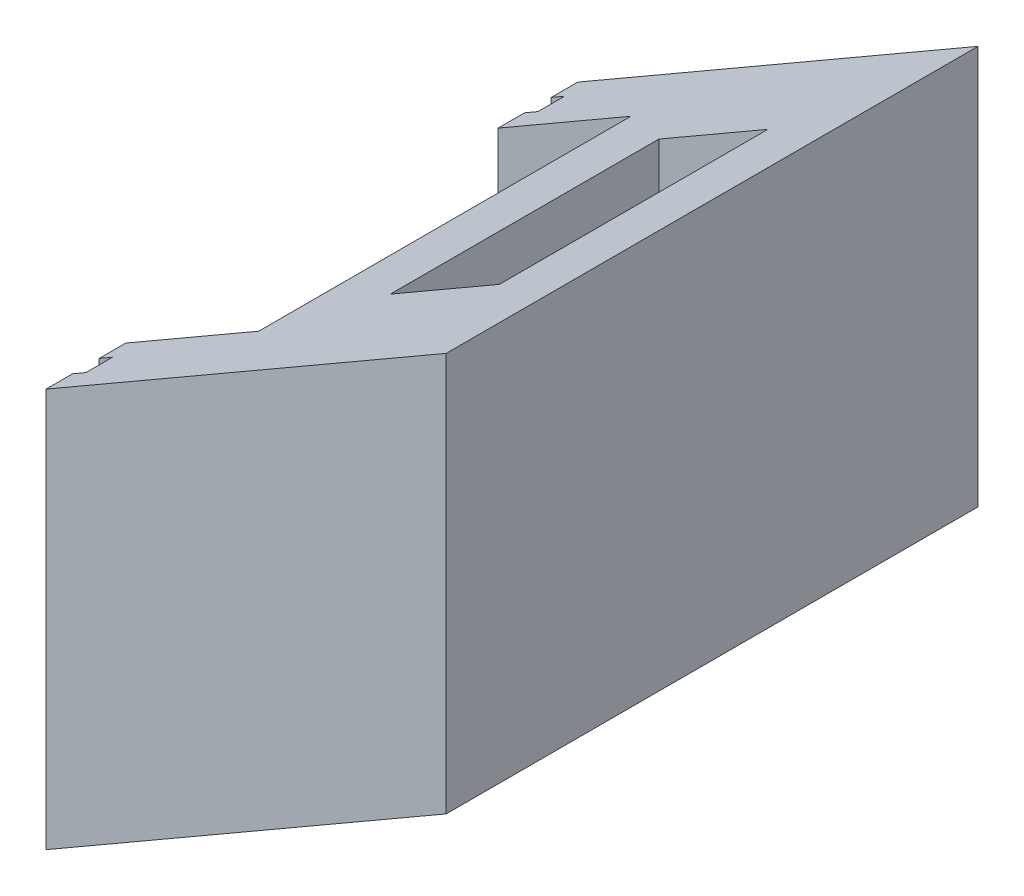
ISO-10303-21;
HEADER;
FILE_DESCRIPTION(('STEP AP214'),'2;1');
FILE_NAME('part.step','',(''),(''),'','','');
FILE_SCHEMA(('AUTOMOTIVE_DESIGN { 1 0 10303 214 1 1 1 1 }'));
ENDSEC;
DATA;
#1=APPLICATION_CONTEXT('core data for automotive mechanical design processes');
#2=APPLICATION_PROTOCOL_DEFINITION('international standard','automotive_design',2000,#1);
#3=PRODUCT_CONTEXT('',#1,'mechanical');
#4=PRODUCT('Part','Part','',(#3));
#5=PRODUCT_RELATED_PRODUCT_CATEGORY('part','',(#4));
#6=PRODUCT_DEFINITION_FORMATION('','',#4);
#7=PRODUCT_DEFINITION_CONTEXT('part definition',#1,'design');
#8=PRODUCT_DEFINITION('design','',#6,#7);
#9=PRODUCT_DEFINITION_SHAPE('','',#8);
#10=(LENGTH_UNIT() NAMED_UNIT(*) SI_UNIT(.MILLI.,.METRE.));
#11=(NAMED_UNIT(*) PLANE_ANGLE_UNIT() SI_UNIT($,.RADIAN.));
#12=(NAMED_UNIT(*) SI_UNIT($,.STERADIAN.) SOLID_ANGLE_UNIT());
#13=UNCERTAINTY_MEASURE_WITH_UNIT(LENGTH_MEASURE(1.E-05),#10,'distance_accuracy_value','');
#14=(GEOMETRIC_REPRESENTATION_CONTEXT(3) GLOBAL_UNCERTAINTY_ASSIGNED_CONTEXT((#13)) GLOBAL_UNIT_ASSIGNED_CONTEXT((#10,
#11,#12)) REPRESENTATION_CONTEXT('',''));
#15=CARTESIAN_POINT('',(0.,0.,0.));
#16=DIRECTION('',(0.,0.,1.));
#17=DIRECTION('',(1.,0.,0.));
#18=AXIS2_PLACEMENT_3D('',#15,#16,#17);
#19=CARTESIAN_POINT('',(-10.05,0.,0.));
#20=DIRECTION('',(-1.,0.,0.));
#21=DIRECTION('',(0.,0.,1.));
#22=AXIS2_PLACEMENT_3D('',#19,#20,#21);
#23=PLANE('',#22);
#24=DIRECTION('',(0.,0.,-1.));
#25=VECTOR('',#24,1.);
#26=CARTESIAN_POINT('',(-10.05,15.,7.));
#27=LINE('',#26,#25);
#28=CARTESIAN_POINT('',(-10.0499999999784,14.9999999999864,9.99999999999091));
#29=VERTEX_POINT('',#28);
#30=CARTESIAN_POINT('',(-10.050000000092,14.9999999999295,9.00000000001455));
#31=VERTEX_POINT('',#30);
#32=EDGE_CURVE('E239',#29,#31,#27,.T.);
#33=ORIENTED_EDGE('',*,*,#32,.T.);
#34=DIRECTION('',(0.,-1.,0.));
#35=VECTOR('',#34,1.);
#36=CARTESIAN_POINT('',(-10.05,0.,9.));
#37=LINE('',#36,#35);
#38=CARTESIAN_POINT('',(-10.05,0.99999999999999,9.));
#39=VERTEX_POINT('',#38);
#40=EDGE_CURVE('E249',#31,#39,#37,.T.);
#41=ORIENTED_EDGE('',*,*,#40,.T.);
#42=DIRECTION('',(0.,0.,-1.));
#43=VECTOR('',#42,1.);
#44=CARTESIAN_POINT('',(-10.05,1.,0.));
#45=LINE('',#44,#43);
#46=CARTESIAN_POINT('',(-10.05,1.,-9.));
#47=VERTEX_POINT('',#46);
#48=EDGE_CURVE('E257',#39,#47,#45,.T.);
#49=ORIENTED_EDGE('',*,*,#48,.T.);
#50=DIRECTION('',(0.,-1.,0.));
#51=VECTOR('',#50,1.);
#52=CARTESIAN_POINT('',(-10.05,0.,-9.));
#53=LINE('',#52,#51);
#54=CARTESIAN_POINT('',(-10.0499999999784,14.9999999999864,-9.00000000001455));
#55=VERTEX_POINT('',#54);
#56=EDGE_CURVE('E371',#55,#47,#53,.T.);
#57=ORIENTED_EDGE('',*,*,#56,.F.);
#58=DIRECTION('',(0.,0.,-1.));
#59=VECTOR('',#58,1.);
#60=CARTESIAN_POINT('',(-10.05,15.,-7.));
#61=LINE('',#60,#59);
#62=CARTESIAN_POINT('',(-10.050000000092,14.9999999999579,-9.99999999998481));
#63=VERTEX_POINT('',#62);
#64=EDGE_CURVE('E314',#55,#63,#61,.T.);
#65=ORIENTED_EDGE('',*,*,#64,.T.);
#66=DIRECTION('',(0.,-1.,0.));
#67=VECTOR('',#66,1.);
#68=CARTESIAN_POINT('',(-10.05,15.,-10.));
#69=LINE('',#68,#67);
#70=CARTESIAN_POINT('',(-10.05,0.,-10.));
#71=VERTEX_POINT('',#70);
#72=EDGE_CURVE('E318',#63,#71,#69,.T.);
#73=ORIENTED_EDGE('',*,*,#72,.T.);
#74=DIRECTION('',(0.,0.,1.));
#75=VECTOR('',#74,1.);
#76=CARTESIAN_POINT('',(-10.05,0.,-10.));
#77=LINE('',#76,#75);
#78=CARTESIAN_POINT('',(-10.05,0.,10.));
#79=VERTEX_POINT('',#78);
#80=EDGE_CURVE('E320',#71,#79,#77,.T.);
#81=ORIENTED_EDGE('',*,*,#80,.T.);
#82=DIRECTION('',(0.,1.,0.));
#83=VECTOR('',#82,1.);
#84=CARTESIAN_POINT('',(-10.05,15.,10.));
#85=LINE('',#84,#83);
#86=EDGE_CURVE('E262',#79,#29,#85,.T.);
#87=ORIENTED_EDGE('',*,*,#86,.T.);
#88=EDGE_LOOP('',(#33,#41,#49,#57,#65,#73,#81,#87));
#89=FACE_BOUND('',#88,.T.);
#90=ADVANCED_FACE('F94',(#89),#23,.T.);
#91=CARTESIAN_POINT('',(-10.0499999999784,14.9999999999864,-7.000000000005));
#92=VERTEX_POINT('',#91);
#93=CARTESIAN_POINT('',(-10.050000000092,14.9999999999295,-7.99999999998136));
#94=VERTEX_POINT('',#93);
#95=EDGE_CURVE('E315',#92,#94,#61,.T.);
#96=ORIENTED_EDGE('',*,*,#95,.T.);
#97=DIRECTION('',(0.,-1.,0.));
#98=VECTOR('',#97,1.);
#99=CARTESIAN_POINT('',(-10.05,0.,-8.));
#100=LINE('',#99,#98);
#101=CARTESIAN_POINT('',(-10.05,2.,-8.));
#102=VERTEX_POINT('',#101);
#103=EDGE_CURVE('E368',#94,#102,#100,.T.);
#104=ORIENTED_EDGE('',*,*,#103,.T.);
#105=DIRECTION('',(0.,0.,1.));
#106=VECTOR('',#105,1.);
#107=CARTESIAN_POINT('',(-10.05,2.,0.));
#108=LINE('',#107,#106);
#109=CARTESIAN_POINT('',(-10.05,1.99999999999999,8.));
#110=VERTEX_POINT('',#109);
#111=EDGE_CURVE('E365',#102,#110,#108,.T.);
#112=ORIENTED_EDGE('',*,*,#111,.T.);
#113=DIRECTION('',(0.,-1.,0.));
#114=VECTOR('',#113,1.);
#115=CARTESIAN_POINT('',(-10.05,0.,8.));
#116=LINE('',#115,#114);
#117=CARTESIAN_POINT('',(-10.0499999999784,14.9999999999864,7.99999999998136));
#118=VERTEX_POINT('',#117);
#119=EDGE_CURVE('E362',#118,#110,#116,.T.);
#120=ORIENTED_EDGE('',*,*,#119,.F.);
#121=CARTESIAN_POINT('',(-10.0500000000352,14.9999999999579,7.00000000000175));
#122=VERTEX_POINT('',#121);
#123=EDGE_CURVE('E264',#118,#122,#27,.T.);
#124=ORIENTED_EDGE('',*,*,#123,.T.);
#125=DIRECTION('',(0.,-1.,0.));
#126=VECTOR('',#125,1.);
#127=CARTESIAN_POINT('',(-10.05,15.,7.));
#128=LINE('',#127,#126);
#129=CARTESIAN_POINT('',(-10.05,3.,7.));
#130=VERTEX_POINT('',#129);
#131=EDGE_CURVE('E263',#122,#130,#128,.T.);
#132=ORIENTED_EDGE('',*,*,#131,.T.);
#133=DIRECTION('',(0.,0.,-1.));
#134=VECTOR('',#133,1.);
#135=CARTESIAN_POINT('',(-10.05,3.,-7.));
#136=LINE('',#135,#134);
#137=CARTESIAN_POINT('',(-10.05,3.,-7.));
#138=VERTEX_POINT('',#137);
#139=EDGE_CURVE('E266',#130,#138,#136,.T.);
#140=ORIENTED_EDGE('',*,*,#139,.T.);
#141=DIRECTION('',(0.,1.,0.));
#142=VECTOR('',#141,1.);
#143=CARTESIAN_POINT('',(-10.05,15.,-7.));
#144=LINE('',#143,#142);
#145=EDGE_CURVE('E277',#138,#92,#144,.T.);
#146=ORIENTED_EDGE('',*,*,#145,.T.);
#147=EDGE_LOOP('',(#96,#104,#112,#120,#124,#132,#140,#146));
#148=FACE_BOUND('',#147,.T.);
#149=ADVANCED_FACE('F411',(#148),#23,.T.);
#150=CARTESIAN_POINT('',(-5.05,0.,0.));
#151=DIRECTION('',(1.,0.,0.));
#152=DIRECTION('',(0.,0.,-1.));
#153=AXIS2_PLACEMENT_3D('',#150,#151,#152);
#154=PLANE('',#153);
#155=DIRECTION('',(0.,1.,0.));
#156=VECTOR('',#155,1.);
#157=CARTESIAN_POINT('',(-5.05,15.,-7.));
#158=LINE('',#157,#156);
#159=CARTESIAN_POINT('',(-5.05,3.,-7.));
#160=VERTEX_POINT('',#159);
#161=CARTESIAN_POINT('',(-5.05000000009659,17.886751345884,-7.000000000005));
#162=VERTEX_POINT('',#161);
#163=EDGE_CURVE('E98',#160,#162,#158,.T.);
#164=ORIENTED_EDGE('',*,*,#163,.F.);
#165=DIRECTION('',(0.,0.,-1.));
#166=VECTOR('',#165,1.);
#167=CARTESIAN_POINT('',(-5.05,3.,-7.));
#168=LINE('',#167,#166);
#169=CARTESIAN_POINT('',(-5.05,3.,7.));
#170=VERTEX_POINT('',#169);
#171=EDGE_CURVE('E275',#170,#160,#168,.T.);
#172=ORIENTED_EDGE('',*,*,#171,.F.);
#173=DIRECTION('',(0.,-1.,0.));
#174=VECTOR('',#173,1.);
#175=CARTESIAN_POINT('',(-5.05,15.,7.));
#176=LINE('',#175,#174);
#177=CARTESIAN_POINT('',(-5.0499999999829,17.8867513459409,7.000000000005));
#178=VERTEX_POINT('',#177);
#179=EDGE_CURVE('E278',#178,#170,#176,.T.);
#180=ORIENTED_EDGE('',*,*,#179,.F.);
#181=DIRECTION('',(0.,0.,-1.));
#182=VECTOR('',#181,1.);
#183=CARTESIAN_POINT('',(-5.0499999999829,17.8867513459409,291590.501918944));
#184=LINE('',#183,#182);
#185=EDGE_CURVE('E672',#178,#162,#184,.T.);
#186=ORIENTED_EDGE('',*,*,#185,.T.);
#187=EDGE_LOOP('',(#164,#172,#180,#186));
#188=FACE_BOUND('',#187,.T.);
#189=ADVANCED_FACE('F416',(#188),#154,.F.);
#190=CARTESIAN_POINT('',(5.,15.,10.));
#191=DIRECTION('',(-1.,0.,0.));
#192=DIRECTION('',(0.,0.,1.));
#193=AXIS2_PLACEMENT_3D('',#190,#191,#192);
#194=PLANE('',#193);
#195=DIRECTION('',(0.,-1.,0.));
#196=VECTOR('',#195,1.);
#197=CARTESIAN_POINT('',(5.,15.,10.));
#198=LINE('',#197,#196);
#199=CARTESIAN_POINT('',(4.99999999993861,23.6891215512287,10.0000000000139));
#200=VERTEX_POINT('',#199);
#201=CARTESIAN_POINT('',(5.,8.6891215513039,10.));
#202=VERTEX_POINT('',#201);
#203=EDGE_CURVE('E104',#200,#202,#198,.T.);
#204=ORIENTED_EDGE('',*,*,#203,.T.);
#205=DIRECTION('',(0.,0.,1.));
#206=VECTOR('',#205,1.);
#207=CARTESIAN_POINT('',(5.,8.6891215513039,-10.));
#208=LINE('',#207,#206);
#209=CARTESIAN_POINT('',(5.,8.6891215513039,-10.));
#210=VERTEX_POINT('',#209);
#211=EDGE_CURVE('E383',#210,#202,#208,.T.);
#212=ORIENTED_EDGE('',*,*,#211,.F.);
#213=DIRECTION('',(0.,-1.,0.));
#214=VECTOR('',#213,1.);
#215=CARTESIAN_POINT('',(5.,15.,-10.));
#216=LINE('',#215,#214);
#217=CARTESIAN_POINT('',(4.99999999999545,23.6891215512856,-9.99999999999091));
#218=VERTEX_POINT('',#217);
#219=EDGE_CURVE('E12',#218,#210,#216,.T.);
#220=ORIENTED_EDGE('',*,*,#219,.F.);
#221=DIRECTION('',(0.,0.,1.));
#222=VECTOR('',#221,1.);
#223=CARTESIAN_POINT('',(4.99999999999545,23.6891215512856,291590.501918944));
#224=LINE('',#223,#222);
#225=EDGE_CURVE('E331',#218,#200,#224,.T.);
#226=ORIENTED_EDGE('',*,*,#225,.T.);
#227=EDGE_LOOP('',(#204,#212,#220,#226));
#228=FACE_BOUND('',#227,.T.);
#229=ADVANCED_FACE('F96',(#228),#194,.F.);
#230=CARTESIAN_POINT('',(-5.,15.,-10.));
#231=DIRECTION('',(0.,0.,1.));
#232=DIRECTION('',(1.,0.,0.));
#233=AXIS2_PLACEMENT_3D('',#230,#231,#232);
#234=PLANE('',#233);
#235=ORIENTED_EDGE('',*,*,#219,.T.);
#236=DIRECTION('',(-0.866025403784438,-0.500000000000001,0.));
#237=VECTOR('',#236,1.);
#238=CARTESIAN_POINT('',(-10.05,0.,-10.));
#239=LINE('',#238,#237);
#240=EDGE_CURVE('E381',#210,#71,#239,.T.);
#241=ORIENTED_EDGE('',*,*,#240,.T.);
#242=ORIENTED_EDGE('',*,*,#72,.F.);
#243=DIRECTION('',(0.866025403784438,0.500000000000001,0.));
#244=VECTOR('',#243,1.);
#245=CARTESIAN_POINT('',(-346419.148383718,-199984.386201576,-10.0000000001046));
#246=LINE('',#245,#244);
#247=EDGE_CURVE('E333',#63,#218,#246,.T.);
#248=ORIENTED_EDGE('',*,*,#247,.T.);
#249=EDGE_LOOP('',(#235,#241,#242,#248));
#250=FACE_BOUND('',#249,.T.);
#251=ADVANCED_FACE('F597',(#250),#234,.F.);
#252=CARTESIAN_POINT('',(-5.,15.,10.));
#253=DIRECTION('',(0.,0.,-1.));
#254=DIRECTION('',(-1.,0.,0.));
#255=AXIS2_PLACEMENT_3D('',#252,#253,#254);
#256=PLANE('',#255);
#257=ORIENTED_EDGE('',*,*,#86,.F.);
#258=DIRECTION('',(-0.866025403784438,-0.500000000000001,0.));
#259=VECTOR('',#258,1.);
#260=CARTESIAN_POINT('',(-10.05,0.,10.));
#261=LINE('',#260,#259);
#262=EDGE_CURVE('E328',#202,#79,#261,.T.);
#263=ORIENTED_EDGE('',*,*,#262,.F.);
#264=ORIENTED_EDGE('',*,*,#203,.F.);
#265=DIRECTION('',(-0.866025403784438,-0.500000000000001,0.));
#266=VECTOR('',#265,1.);
#267=CARTESIAN_POINT('',(-346419.148383718,-199984.386201576,9.99999999993406));
#268=LINE('',#267,#266);
#269=EDGE_CURVE('E245',#200,#29,#268,.T.);
#270=ORIENTED_EDGE('',*,*,#269,.T.);
#271=EDGE_LOOP('',(#257,#263,#264,#270));
#272=FACE_BOUND('',#271,.T.);
#273=ADVANCED_FACE('F327',(#272),#256,.F.);
#274=CARTESIAN_POINT('',(2.05,0.,5.05));
#275=DIRECTION('',(1.,0.,0.));
#276=DIRECTION('',(0.,0.,-1.));
#277=AXIS2_PLACEMENT_3D('',#274,#275,#276);
#278=PLANE('',#277);
#279=DIRECTION('',(0.,1.,0.));
#280=VECTOR('',#279,1.);
#281=CARTESIAN_POINT('',(2.05,0.,-5.05));
#282=LINE('',#281,#280);
#283=CARTESIAN_POINT('',(2.05,6.9859382571945,-5.05));
#284=VERTEX_POINT('',#283);
#285=CARTESIAN_POINT('',(2.04999999994016,21.9859382571315,-5.0499999999829));
#286=VERTEX_POINT('',#285);
#287=EDGE_CURVE('E284',#284,#286,#282,.T.);
#288=ORIENTED_EDGE('',*,*,#287,.F.);
#289=DIRECTION('',(0.,0.,1.));
#290=VECTOR('',#289,1.);
#291=CARTESIAN_POINT('',(2.05,6.9859382571945,5.05));
#292=LINE('',#291,#290);
#293=CARTESIAN_POINT('',(2.05,6.9859382571945,5.05));
#294=VERTEX_POINT('',#293);
#295=EDGE_CURVE('E299',#284,#294,#292,.T.);
#296=ORIENTED_EDGE('',*,*,#295,.T.);
#297=DIRECTION('',(0.,1.,0.));
#298=VECTOR('',#297,1.);
#299=CARTESIAN_POINT('',(2.05,0.,5.05));
#300=LINE('',#299,#298);
#301=CARTESIAN_POINT('',(2.04999999994016,21.9859382571315,5.0499999999829));
#302=VERTEX_POINT('',#301);
#303=EDGE_CURVE('E285',#294,#302,#300,.T.);
#304=ORIENTED_EDGE('',*,*,#303,.T.);
#305=DIRECTION('',(0.,0.,1.));
#306=VECTOR('',#305,1.);
#307=CARTESIAN_POINT('',(2.049999999997,21.9859382571883,291590.501918944));
#308=LINE('',#307,#306);
#309=EDGE_CURVE('E337',#286,#302,#308,.T.);
#310=ORIENTED_EDGE('',*,*,#309,.F.);
#311=EDGE_LOOP('',(#288,#296,#304,#310));
#312=FACE_BOUND('',#311,.T.);
#313=ADVANCED_FACE('F392',(#312),#278,.F.);
#314=CARTESIAN_POINT('',(-2.05,0.,5.05));
#315=DIRECTION('',(0.,0.,1.));
#316=DIRECTION('',(1.,0.,0.));
#317=AXIS2_PLACEMENT_3D('',#314,#315,#316);
#318=PLANE('',#317);
#319=ORIENTED_EDGE('',*,*,#303,.F.);
#320=DIRECTION('',(-0.866025403784438,-0.500000000000001,0.));
#321=VECTOR('',#320,1.);
#322=CARTESIAN_POINT('',(-4.05000000000001,3.46410161513776,5.05));
#323=LINE('',#322,#321);
#324=CARTESIAN_POINT('',(-2.05,4.61880215351702,5.05));
#325=VERTEX_POINT('',#324);
#326=EDGE_CURVE('E303',#294,#325,#323,.T.);
#327=ORIENTED_EDGE('',*,*,#326,.T.);
#328=DIRECTION('',(0.,1.,0.));
#329=VECTOR('',#328,1.);
#330=CARTESIAN_POINT('',(-2.05,0.,5.05));
#331=LINE('',#330,#329);
#332=CARTESIAN_POINT('',(-2.049999999997,19.6188021535022,5.0499999999829));
#333=VERTEX_POINT('',#332);
#334=EDGE_CURVE('E287',#325,#333,#331,.T.);
#335=ORIENTED_EDGE('',*,*,#334,.T.);
#336=DIRECTION('',(-0.866025403784438,-0.500000000000001,0.));
#337=VECTOR('',#336,1.);
#338=CARTESIAN_POINT('',(-346419.148383718,-199984.386201576,5.0499999999829));
#339=LINE('',#338,#337);
#340=EDGE_CURVE('E340',#302,#333,#339,.T.);
#341=ORIENTED_EDGE('',*,*,#340,.F.);
#342=EDGE_LOOP('',(#319,#327,#335,#341));
#343=FACE_BOUND('',#342,.T.);
#344=ADVANCED_FACE('F400',(#343),#318,.F.);
#345=CARTESIAN_POINT('',(-2.05,0.,-5.05));
#346=DIRECTION('',(0.,0.,-1.));
#347=DIRECTION('',(-1.,0.,0.));
#348=AXIS2_PLACEMENT_3D('',#345,#346,#347);
#349=PLANE('',#348);
#350=DIRECTION('',(0.,1.,0.));
#351=VECTOR('',#350,1.);
#352=CARTESIAN_POINT('',(-2.05,0.,-5.05));
#353=LINE('',#352,#351);
#354=CARTESIAN_POINT('',(-2.05,4.61880215351702,-5.05));
#355=VERTEX_POINT('',#354);
#356=CARTESIAN_POINT('',(-2.05000000011069,19.6188021534454,-5.0499999999829));
#357=VERTEX_POINT('',#356);
#358=EDGE_CURVE('E289',#355,#357,#353,.T.);
#359=ORIENTED_EDGE('',*,*,#358,.F.);
#360=DIRECTION('',(0.866025403784438,0.500000000000001,0.));
#361=VECTOR('',#360,1.);
#362=CARTESIAN_POINT('',(-4.05000000000001,3.46410161513776,-5.05));
#363=LINE('',#362,#361);
#364=EDGE_CURVE('E112',#355,#284,#363,.T.);
#365=ORIENTED_EDGE('',*,*,#364,.T.);
#366=ORIENTED_EDGE('',*,*,#287,.T.);
#367=DIRECTION('',(0.866025403784438,0.500000000000001,0.));
#368=VECTOR('',#367,1.);
#369=CARTESIAN_POINT('',(-346419.148383718,-199984.386201576,-5.0499999999829));
#370=LINE('',#369,#368);
#371=EDGE_CURVE('E246',#357,#286,#370,.T.);
#372=ORIENTED_EDGE('',*,*,#371,.F.);
#373=EDGE_LOOP('',(#359,#365,#366,#372));
#374=FACE_BOUND('',#373,.T.);
#375=ADVANCED_FACE('F389',(#374),#349,.F.);
#376=CARTESIAN_POINT('',(-2.05,0.,0.));
#377=DIRECTION('',(1.,0.,0.));
#378=DIRECTION('',(0.,0.,-1.));
#379=AXIS2_PLACEMENT_3D('',#376,#377,#378);
#380=PLANE('',#379);
#381=DIRECTION('',(0.,0.,1.));
#382=VECTOR('',#381,1.);
#383=CARTESIAN_POINT('',(-2.05,4.61880215351702,0.));
#384=LINE('',#383,#382);
#385=EDGE_CURVE('E386',#355,#325,#384,.T.);
#386=ORIENTED_EDGE('',*,*,#385,.F.);
#387=ORIENTED_EDGE('',*,*,#358,.T.);
#388=DIRECTION('',(0.,0.,-1.));
#389=VECTOR('',#388,1.);
#390=CARTESIAN_POINT('',(-2.049999999997,19.6188021535022,291590.501918944));
#391=LINE('',#390,#389);
#392=EDGE_CURVE('E343',#333,#357,#391,.T.);
#393=ORIENTED_EDGE('',*,*,#392,.F.);
#394=ORIENTED_EDGE('',*,*,#334,.F.);
#395=EDGE_LOOP('',(#386,#387,#393,#394));
#396=FACE_BOUND('',#395,.T.);
#397=ADVANCED_FACE('F397',(#396),#380,.T.);
#398=CARTESIAN_POINT('',(-10.05,15.,-7.));
#399=DIRECTION('',(0.,0.,-1.));
#400=DIRECTION('',(0.,1.,0.));
#401=AXIS2_PLACEMENT_3D('',#398,#399,#400);
#402=PLANE('',#401);
#403=ORIENTED_EDGE('',*,*,#163,.T.);
#404=DIRECTION('',(-0.866025403784438,-0.500000000000001,0.));
#405=VECTOR('',#404,1.);
#406=CARTESIAN_POINT('',(-346419.148383718,-199984.386201576,-7.000000000005));
#407=LINE('',#406,#405);
#408=EDGE_CURVE('E670',#162,#92,#407,.T.);
#409=ORIENTED_EDGE('',*,*,#408,.T.);
#410=ORIENTED_EDGE('',*,*,#145,.F.);
#411=DIRECTION('',(1.,0.,0.));
#412=VECTOR('',#411,1.);
#413=CARTESIAN_POINT('',(-10.05,3.,-7.));
#414=LINE('',#413,#412);
#415=EDGE_CURVE('E272',#138,#160,#414,.T.);
#416=ORIENTED_EDGE('',*,*,#415,.T.);
#417=EDGE_LOOP('',(#403,#409,#410,#416));
#418=FACE_BOUND('',#417,.T.);
#419=ADVANCED_FACE('F428',(#418),#402,.F.);
#420=CARTESIAN_POINT('',(-10.05,15.,7.));
#421=DIRECTION('',(0.,0.,1.));
#422=DIRECTION('',(0.,-1.,0.));
#423=AXIS2_PLACEMENT_3D('',#420,#421,#422);
#424=PLANE('',#423);
#425=ORIENTED_EDGE('',*,*,#179,.T.);
#426=DIRECTION('',(1.,0.,0.));
#427=VECTOR('',#426,1.);
#428=CARTESIAN_POINT('',(-10.05,3.,7.));
#429=LINE('',#428,#427);
#430=EDGE_CURVE('E281',#130,#170,#429,.T.);
#431=ORIENTED_EDGE('',*,*,#430,.F.);
#432=ORIENTED_EDGE('',*,*,#131,.F.);
#433=DIRECTION('',(0.866025403784438,0.500000000000001,0.));
#434=VECTOR('',#433,1.);
#435=CARTESIAN_POINT('',(-346419.148383718,-199984.386201576,7.00000000006185));
#436=LINE('',#435,#434);
#437=EDGE_CURVE('E674',#122,#178,#436,.T.);
#438=ORIENTED_EDGE('',*,*,#437,.T.);
#439=EDGE_LOOP('',(#425,#431,#432,#438));
#440=FACE_BOUND('',#439,.T.);
#441=ADVANCED_FACE('F424',(#440),#424,.F.);
#442=CARTESIAN_POINT('',(-10.05,3.,-7.));
#443=DIRECTION('',(0.,-1.,0.));
#444=DIRECTION('',(0.,0.,-1.));
#445=AXIS2_PLACEMENT_3D('',#442,#443,#444);
#446=PLANE('',#445);
#447=ORIENTED_EDGE('',*,*,#171,.T.);
#448=ORIENTED_EDGE('',*,*,#415,.F.);
#449=ORIENTED_EDGE('',*,*,#139,.F.);
#450=ORIENTED_EDGE('',*,*,#430,.T.);
#451=EDGE_LOOP('',(#447,#448,#449,#450));
#452=FACE_BOUND('',#451,.T.);
#453=ADVANCED_FACE('F421',(#452),#446,.F.);
#454=CARTESIAN_POINT('',(-10.05,0.,-10.));
#455=DIRECTION('',(-0.500000000000001,0.866025403784438,0.));
#456=DIRECTION('',(-0.866025403784438,-0.500000000000001,0.));
#457=AXIS2_PLACEMENT_3D('',#454,#455,#456);
#458=PLANE('',#457);
#459=ORIENTED_EDGE('',*,*,#262,.T.);
#460=ORIENTED_EDGE('',*,*,#80,.F.);
#461=ORIENTED_EDGE('',*,*,#240,.F.);
#462=ORIENTED_EDGE('',*,*,#211,.T.);
#463=EDGE_LOOP('',(#459,#460,#461,#462));
#464=FACE_BOUND('',#463,.T.);
#465=ORIENTED_EDGE('',*,*,#364,.F.);
#466=ORIENTED_EDGE('',*,*,#385,.T.);
#467=ORIENTED_EDGE('',*,*,#326,.F.);
#468=ORIENTED_EDGE('',*,*,#295,.F.);
#469=EDGE_LOOP('',(#465,#466,#467,#468));
#470=FACE_BOUND('',#469,.T.);
#471=ADVANCED_FACE('F398',(#464,#470),#458,.F.);
#472=CARTESIAN_POINT('',(-9.55,0.,9.));
#473=DIRECTION('',(0.,0.,-1.));
#474=DIRECTION('',(0.,1.,0.));
#475=AXIS2_PLACEMENT_3D('',#472,#473,#474);
#476=PLANE('',#475);
#477=ORIENTED_EDGE('',*,*,#40,.F.);
#478=DIRECTION('',(0.866025403784438,0.500000000000001,0.));
#479=VECTOR('',#478,1.);
#480=CARTESIAN_POINT('',(-346419.148383718,-199984.386201576,9.00000000001455));
#481=LINE('',#480,#479);
#482=CARTESIAN_POINT('',(-9.55000000010386,15.2886751345136,9.00000000001455));
#483=VERTEX_POINT('',#482);
#484=EDGE_CURVE('E233',#31,#483,#481,.T.);
#485=ORIENTED_EDGE('',*,*,#484,.T.);
#486=DIRECTION('',(0.,-1.,0.));
#487=VECTOR('',#486,1.);
#488=CARTESIAN_POINT('',(-9.55,0.,9.));
#489=LINE('',#488,#487);
#490=CARTESIAN_POINT('',(-9.55,0.99999999999999,9.));
#491=VERTEX_POINT('',#490);
#492=EDGE_CURVE('E359',#483,#491,#489,.T.);
#493=ORIENTED_EDGE('',*,*,#492,.T.);
#494=DIRECTION('',(-1.,0.,0.));
#495=VECTOR('',#494,1.);
#496=CARTESIAN_POINT('',(-9.55,0.99999999999999,9.));
#497=LINE('',#496,#495);
#498=EDGE_CURVE('E252',#491,#39,#497,.T.);
#499=ORIENTED_EDGE('',*,*,#498,.T.);
#500=EDGE_LOOP('',(#477,#485,#493,#499));
#501=FACE_BOUND('',#500,.T.);
#502=ADVANCED_FACE('F250',(#501),#476,.T.);
#503=CARTESIAN_POINT('',(-9.55,1.,0.));
#504=DIRECTION('',(0.,1.,0.));
#505=DIRECTION('',(0.,0.,1.));
#506=AXIS2_PLACEMENT_3D('',#503,#504,#505);
#507=PLANE('',#506);
#508=ORIENTED_EDGE('',*,*,#48,.F.);
#509=ORIENTED_EDGE('',*,*,#498,.F.);
#510=DIRECTION('',(0.,0.,-1.));
#511=VECTOR('',#510,1.);
#512=CARTESIAN_POINT('',(-9.55,1.,0.));
#513=LINE('',#512,#511);
#514=CARTESIAN_POINT('',(-9.55,1.,-9.));
#515=VERTEX_POINT('',#514);
#516=EDGE_CURVE('E357',#491,#515,#513,.T.);
#517=ORIENTED_EDGE('',*,*,#516,.T.);
#518=DIRECTION('',(-1.,0.,0.));
#519=VECTOR('',#518,1.);
#520=CARTESIAN_POINT('',(-9.55,1.,-9.));
#521=LINE('',#520,#519);
#522=EDGE_CURVE('E376',#515,#47,#521,.T.);
#523=ORIENTED_EDGE('',*,*,#522,.T.);
#524=EDGE_LOOP('',(#508,#509,#517,#523));
#525=FACE_BOUND('',#524,.T.);
#526=ADVANCED_FACE('F461',(#525),#507,.T.);
#527=CARTESIAN_POINT('',(-9.55,0.,-9.));
#528=DIRECTION('',(0.,0.,-1.));
#529=DIRECTION('',(-1.,0.,0.));
#530=AXIS2_PLACEMENT_3D('',#527,#528,#529);
#531=PLANE('',#530);
#532=ORIENTED_EDGE('',*,*,#56,.T.);
#533=ORIENTED_EDGE('',*,*,#522,.F.);
#534=DIRECTION('',(0.,-1.,0.));
#535=VECTOR('',#534,1.);
#536=CARTESIAN_POINT('',(-9.55,0.,-9.));
#537=LINE('',#536,#535);
#538=CARTESIAN_POINT('',(-9.55000000010386,15.2886751345136,-9.00000000001455));
#539=VERTEX_POINT('',#538);
#540=EDGE_CURVE('E354',#539,#515,#537,.T.);
#541=ORIENTED_EDGE('',*,*,#540,.F.);
#542=DIRECTION('',(-0.866025403784438,-0.500000000000001,0.));
#543=VECTOR('',#542,1.);
#544=CARTESIAN_POINT('',(-346419.148383718,-199984.386201576,-9.00000000001455));
#545=LINE('',#544,#543);
#546=EDGE_CURVE('E658',#539,#55,#545,.T.);
#547=ORIENTED_EDGE('',*,*,#546,.T.);
#548=EDGE_LOOP('',(#532,#533,#541,#547));
#549=FACE_BOUND('',#548,.T.);
#550=ADVANCED_FACE('F468',(#549),#531,.F.);
#551=CARTESIAN_POINT('',(-9.55,0.,-8.));
#552=DIRECTION('',(0.,0.,-1.));
#553=DIRECTION('',(-1.,0.,0.));
#554=AXIS2_PLACEMENT_3D('',#551,#552,#553);
#555=PLANE('',#554);
#556=ORIENTED_EDGE('',*,*,#103,.F.);
#557=DIRECTION('',(0.866025403784438,0.500000000000001,0.));
#558=VECTOR('',#557,1.);
#559=CARTESIAN_POINT('',(-346419.148383718,-199984.386201576,-7.99999999998136));
#560=LINE('',#559,#558);
#561=CARTESIAN_POINT('',(-9.54999999999018,15.2886751345704,-7.99999999998136));
#562=VERTEX_POINT('',#561);
#563=EDGE_CURVE('E665',#94,#562,#560,.T.);
#564=ORIENTED_EDGE('',*,*,#563,.T.);
#565=DIRECTION('',(0.,-1.,0.));
#566=VECTOR('',#565,1.);
#567=CARTESIAN_POINT('',(-9.55,0.,-8.));
#568=LINE('',#567,#566);
#569=CARTESIAN_POINT('',(-9.55,2.,-8.));
#570=VERTEX_POINT('',#569);
#571=EDGE_CURVE('E352',#562,#570,#568,.T.);
#572=ORIENTED_EDGE('',*,*,#571,.T.);
#573=DIRECTION('',(-1.,0.,0.));
#574=VECTOR('',#573,1.);
#575=CARTESIAN_POINT('',(-9.55,2.,-8.));
#576=LINE('',#575,#574);
#577=EDGE_CURVE('E378',#570,#102,#576,.T.);
#578=ORIENTED_EDGE('',*,*,#577,.T.);
#579=EDGE_LOOP('',(#556,#564,#572,#578));
#580=FACE_BOUND('',#579,.T.);
#581=ADVANCED_FACE('F476',(#580),#555,.T.);
#582=CARTESIAN_POINT('',(-9.55,2.,0.));
#583=DIRECTION('',(0.,-1.,0.));
#584=DIRECTION('',(0.,0.,-1.));
#585=AXIS2_PLACEMENT_3D('',#582,#583,#584);
#586=PLANE('',#585);
#587=ORIENTED_EDGE('',*,*,#111,.F.);
#588=ORIENTED_EDGE('',*,*,#577,.F.);
#589=DIRECTION('',(0.,0.,1.));
#590=VECTOR('',#589,1.);
#591=CARTESIAN_POINT('',(-9.55,2.,0.));
#592=LINE('',#591,#590);
#593=CARTESIAN_POINT('',(-9.55,1.99999999999999,8.));
#594=VERTEX_POINT('',#593);
#595=EDGE_CURVE('E350',#570,#594,#592,.T.);
#596=ORIENTED_EDGE('',*,*,#595,.T.);
#597=DIRECTION('',(-1.,0.,0.));
#598=VECTOR('',#597,1.);
#599=CARTESIAN_POINT('',(-9.55,1.99999999999999,8.));
#600=LINE('',#599,#598);
#601=EDGE_CURVE('E361',#594,#110,#600,.T.);
#602=ORIENTED_EDGE('',*,*,#601,.T.);
#603=EDGE_LOOP('',(#587,#588,#596,#602));
#604=FACE_BOUND('',#603,.T.);
#605=ADVANCED_FACE('F484',(#604),#586,.T.);
#606=CARTESIAN_POINT('',(-9.55,0.,8.));
#607=DIRECTION('',(0.,0.,-1.));
#608=DIRECTION('',(0.,1.,0.));
#609=AXIS2_PLACEMENT_3D('',#606,#607,#608);
#610=PLANE('',#609);
#611=ORIENTED_EDGE('',*,*,#119,.T.);
#612=ORIENTED_EDGE('',*,*,#601,.F.);
#613=DIRECTION('',(0.,-1.,0.));
#614=VECTOR('',#613,1.);
#615=CARTESIAN_POINT('',(-9.55,0.,8.));
#616=LINE('',#615,#614);
#617=CARTESIAN_POINT('',(-9.55000000010386,15.288675134542,7.99999999995706));
#618=VERTEX_POINT('',#617);
#619=EDGE_CURVE('E256',#618,#594,#616,.T.);
#620=ORIENTED_EDGE('',*,*,#619,.F.);
#621=DIRECTION('',(-0.866025403784438,-0.500000000000001,0.));
#622=VECTOR('',#621,1.);
#623=CARTESIAN_POINT('',(-346419.148383715,-199984.386201574,7.99999999514966));
#624=LINE('',#623,#622);
#625=EDGE_CURVE('E676',#618,#118,#624,.T.);
#626=ORIENTED_EDGE('',*,*,#625,.T.);
#627=EDGE_LOOP('',(#611,#612,#620,#626));
#628=FACE_BOUND('',#627,.T.);
#629=ADVANCED_FACE('F492',(#628),#610,.F.);
#630=CARTESIAN_POINT('',(-9.55,0.,0.));
#631=DIRECTION('',(-1.,0.,0.));
#632=DIRECTION('',(0.,0.,1.));
#633=AXIS2_PLACEMENT_3D('',#630,#631,#632);
#634=PLANE('',#633);
#635=ORIENTED_EDGE('',*,*,#492,.F.);
#636=DIRECTION('',(0.,0.,-1.));
#637=VECTOR('',#636,1.);
#638=CARTESIAN_POINT('',(-9.54999999999018,15.2886751345704,291590.501918944));
#639=LINE('',#638,#637);
#640=EDGE_CURVE('E243',#483,#618,#639,.T.);
#641=ORIENTED_EDGE('',*,*,#640,.T.);
#642=ORIENTED_EDGE('',*,*,#619,.T.);
#643=ORIENTED_EDGE('',*,*,#595,.F.);
#644=ORIENTED_EDGE('',*,*,#571,.F.);
#645=DIRECTION('',(0.,0.,-1.));
#646=VECTOR('',#645,1.);
#647=CARTESIAN_POINT('',(-9.54999999999018,15.2886751345704,291590.501918944));
#648=LINE('',#647,#646);
#649=EDGE_CURVE('E663',#562,#539,#648,.T.);
#650=ORIENTED_EDGE('',*,*,#649,.T.);
#651=ORIENTED_EDGE('',*,*,#540,.T.);
#652=ORIENTED_EDGE('',*,*,#516,.F.);
#653=EDGE_LOOP('',(#635,#641,#642,#643,#644,#650,#651,#652));
#654=FACE_BOUND('',#653,.T.);
#655=ADVANCED_FACE('F499',(#654),#634,.T.);
#656=CARTESIAN_POINT('',(-9.00769052838642,15.6017776540222,0.));
#657=DIRECTION('',(-0.500000000000001,0.866025403784438,0.));
#658=DIRECTION('',(-0.866025403784438,-0.500000000000001,0.));
#659=AXIS2_PLACEMENT_3D('',#656,#657,#658);
#660=PLANE('',#659);
#661=ORIENTED_EDGE('',*,*,#640,.F.);
#662=ORIENTED_EDGE('',*,*,#484,.F.);
#663=ORIENTED_EDGE('',*,*,#32,.F.);
#664=ORIENTED_EDGE('',*,*,#269,.F.);
#665=ORIENTED_EDGE('',*,*,#225,.F.);
#666=ORIENTED_EDGE('',*,*,#247,.F.);
#667=ORIENTED_EDGE('',*,*,#64,.F.);
#668=ORIENTED_EDGE('',*,*,#546,.F.);
#669=ORIENTED_EDGE('',*,*,#649,.F.);
#670=ORIENTED_EDGE('',*,*,#563,.F.);
#671=ORIENTED_EDGE('',*,*,#95,.F.);
#672=ORIENTED_EDGE('',*,*,#408,.F.);
#673=ORIENTED_EDGE('',*,*,#185,.F.);
#674=ORIENTED_EDGE('',*,*,#437,.F.);
#675=ORIENTED_EDGE('',*,*,#123,.F.);
#676=ORIENTED_EDGE('',*,*,#625,.F.);
#677=EDGE_LOOP('',(#661,#662,#663,#664,#665,#666,#667,#668,#669,#670,#671,#672,#673,#674,#675,#676));
#678=FACE_BOUND('',#677,.T.);
#679=ORIENTED_EDGE('',*,*,#309,.T.);
#680=ORIENTED_EDGE('',*,*,#340,.T.);
#681=ORIENTED_EDGE('',*,*,#392,.T.);
#682=ORIENTED_EDGE('',*,*,#371,.T.);
#683=EDGE_LOOP('',(#679,#680,#681,#682));
#684=FACE_BOUND('',#683,.T.);
#685=ADVANCED_FACE('F235',(#678,#684),#660,.T.);
#686=CLOSED_SHELL('',(#90,#149,#189,#229,#251,#273,#313,#344,#375,#397,#419,#441,#453,#471,#502,
#526,#550,#581,#605,#629,#655,#685));
#687=MANIFOLD_SOLID_BREP('B2',#686);
#688=ADVANCED_BREP_SHAPE_REPRESENTATION('',(#18,#687),#14);
#689=SHAPE_DEFINITION_REPRESENTATION(#9,#688);
ENDSEC;
END-ISO-10303-21;
